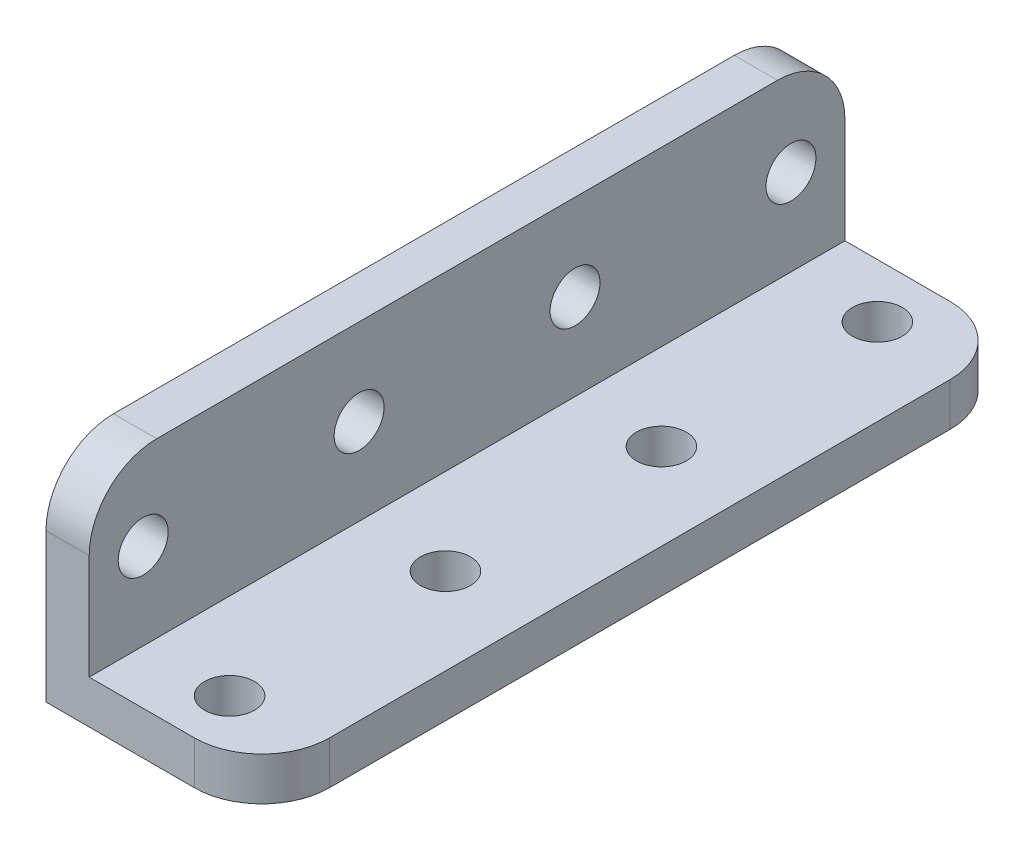
ISO-10303-21;
HEADER;
FILE_DESCRIPTION(('STEP AP214'),'2;1');
FILE_NAME('part.step','',(''),(''),'','','');
FILE_SCHEMA(('AUTOMOTIVE_DESIGN { 1 0 10303 214 1 1 1 1 }'));
ENDSEC;
DATA;
#1=APPLICATION_CONTEXT('core data for automotive mechanical design processes');
#2=APPLICATION_PROTOCOL_DEFINITION('international standard','automotive_design',2000,#1);
#3=PRODUCT_CONTEXT('',#1,'mechanical');
#4=PRODUCT('Part','Part','',(#3));
#5=PRODUCT_RELATED_PRODUCT_CATEGORY('part','',(#4));
#6=PRODUCT_DEFINITION_FORMATION('','',#4);
#7=PRODUCT_DEFINITION_CONTEXT('part definition',#1,'design');
#8=PRODUCT_DEFINITION('design','',#6,#7);
#9=PRODUCT_DEFINITION_SHAPE('','',#8);
#10=(LENGTH_UNIT() NAMED_UNIT(*) SI_UNIT(.MILLI.,.METRE.));
#11=(NAMED_UNIT(*) PLANE_ANGLE_UNIT() SI_UNIT($,.RADIAN.));
#12=(NAMED_UNIT(*) SI_UNIT($,.STERADIAN.) SOLID_ANGLE_UNIT());
#13=UNCERTAINTY_MEASURE_WITH_UNIT(LENGTH_MEASURE(1.E-05),#10,'distance_accuracy_value','');
#14=(GEOMETRIC_REPRESENTATION_CONTEXT(3) GLOBAL_UNCERTAINTY_ASSIGNED_CONTEXT((#13)) GLOBAL_UNIT_ASSIGNED_CONTEXT((#10,
#11,#12)) REPRESENTATION_CONTEXT('',''));
#15=CARTESIAN_POINT('',(0.,0.,0.));
#16=DIRECTION('',(0.,0.,1.));
#17=DIRECTION('',(1.,0.,0.));
#18=AXIS2_PLACEMENT_3D('',#15,#16,#17);
#19=CARTESIAN_POINT('',(16.,0.,0.));
#20=DIRECTION('',(1.,0.,0.));
#21=DIRECTION('',(0.,0.,-1.));
#22=AXIS2_PLACEMENT_3D('',#19,#20,#21);
#23=PLANE('',#22);
#24=DIRECTION('',(0.,0.,1.));
#25=VECTOR('',#24,1.);
#26=CARTESIAN_POINT('',(16.,3.2,0.));
#27=LINE('',#26,#25);
#28=CARTESIAN_POINT('',(16.,3.2,-25.));
#29=VERTEX_POINT('',#28);
#30=CARTESIAN_POINT('',(16.,3.2,-71.));
#31=VERTEX_POINT('',#30);
#32=EDGE_CURVE('E160',#29,#31,#27,.F.);
#33=ORIENTED_EDGE('',*,*,#32,.F.);
#34=DIRECTION('',(0.,1.,0.));
#35=VECTOR('',#34,1.);
#36=CARTESIAN_POINT('',(16.,0.,-25.));
#37=LINE('',#36,#35);
#38=CARTESIAN_POINT('',(16.,0.,-25.));
#39=VERTEX_POINT('',#38);
#40=EDGE_CURVE('E50',#29,#39,#37,.F.);
#41=ORIENTED_EDGE('',*,*,#40,.T.);
#42=DIRECTION('',(0.,0.,-1.));
#43=VECTOR('',#42,1.);
#44=CARTESIAN_POINT('',(16.,0.,0.));
#45=LINE('',#44,#43);
#46=CARTESIAN_POINT('',(16.,0.,-71.));
#47=VERTEX_POINT('',#46);
#48=EDGE_CURVE('E140',#47,#39,#45,.F.);
#49=ORIENTED_EDGE('',*,*,#48,.F.);
#50=DIRECTION('',(0.,1.,0.));
#51=VECTOR('',#50,1.);
#52=CARTESIAN_POINT('',(16.,3.2,-71.));
#53=LINE('',#52,#51);
#54=EDGE_CURVE('E420',#47,#31,#53,.T.);
#55=ORIENTED_EDGE('',*,*,#54,.T.);
#56=EDGE_LOOP('',(#33,#41,#49,#55));
#57=FACE_BOUND('',#56,.T.);
#58=ADVANCED_FACE('F35',(#57),#23,.T.);
#59=CARTESIAN_POINT('',(9.6,3.2,-24.));
#60=DIRECTION('',(0.,-1.,0.));
#61=DIRECTION('',(0.,0.,-1.));
#62=AXIS2_PLACEMENT_3D('',#59,#60,#61);
#63=CYLINDRICAL_SURFACE('',#62,1.85);
#64=CARTESIAN_POINT('',(9.6,3.2,-24.));
#65=DIRECTION('',(0.,-1.,0.));
#66=DIRECTION('',(0.,0.,-1.));
#67=AXIS2_PLACEMENT_3D('',#64,#65,#66);
#68=CIRCLE('',#67,1.85);
#69=CARTESIAN_POINT('',(9.6,3.2,-25.85));
#70=VERTEX_POINT('',#69);
#71=EDGE_CURVE('E162',#70,#70,#68,.T.);
#72=ORIENTED_EDGE('',*,*,#71,.F.);
#73=EDGE_LOOP('',(#72));
#74=FACE_BOUND('',#73,.T.);
#75=CARTESIAN_POINT('',(9.6,0.,-24.));
#76=DIRECTION('',(0.,-1.,0.));
#77=DIRECTION('',(0.,0.,-1.));
#78=AXIS2_PLACEMENT_3D('',#75,#76,#77);
#79=CIRCLE('',#78,1.85);
#80=CARTESIAN_POINT('',(9.6,0.,-25.85));
#81=VERTEX_POINT('',#80);
#82=EDGE_CURVE('E143',#81,#81,#79,.F.);
#83=ORIENTED_EDGE('',*,*,#82,.F.);
#84=EDGE_LOOP('',(#83));
#85=FACE_BOUND('',#84,.T.);
#86=ADVANCED_FACE('F208',(#74,#85),#63,.F.);
#87=CARTESIAN_POINT('',(9.6,3.2,-40.));
#88=DIRECTION('',(0.,-1.,0.));
#89=DIRECTION('',(0.,0.,-1.));
#90=AXIS2_PLACEMENT_3D('',#87,#88,#89);
#91=CYLINDRICAL_SURFACE('',#90,1.85);
#92=CARTESIAN_POINT('',(9.6,3.2,-40.));
#93=DIRECTION('',(0.,-1.,0.));
#94=DIRECTION('',(0.,0.,-1.));
#95=AXIS2_PLACEMENT_3D('',#92,#93,#94);
#96=CIRCLE('',#95,1.85);
#97=CARTESIAN_POINT('',(9.6,3.2,-41.85));
#98=VERTEX_POINT('',#97);
#99=EDGE_CURVE('E202',#98,#98,#96,.T.);
#100=ORIENTED_EDGE('',*,*,#99,.F.);
#101=EDGE_LOOP('',(#100));
#102=FACE_BOUND('',#101,.T.);
#103=CARTESIAN_POINT('',(9.6,0.,-40.));
#104=DIRECTION('',(0.,-1.,0.));
#105=DIRECTION('',(0.,0.,-1.));
#106=AXIS2_PLACEMENT_3D('',#103,#104,#105);
#107=CIRCLE('',#106,1.85);
#108=CARTESIAN_POINT('',(9.6,0.,-41.85));
#109=VERTEX_POINT('',#108);
#110=EDGE_CURVE('E195',#109,#109,#107,.F.);
#111=ORIENTED_EDGE('',*,*,#110,.F.);
#112=EDGE_LOOP('',(#111));
#113=FACE_BOUND('',#112,.T.);
#114=ADVANCED_FACE('F211',(#102,#113),#91,.F.);
#115=CARTESIAN_POINT('',(9.6,3.2,-56.));
#116=DIRECTION('',(0.,-1.,0.));
#117=DIRECTION('',(0.,0.,-1.));
#118=AXIS2_PLACEMENT_3D('',#115,#116,#117);
#119=CYLINDRICAL_SURFACE('',#118,1.85);
#120=CARTESIAN_POINT('',(9.6,3.2,-56.));
#121=DIRECTION('',(0.,-1.,0.));
#122=DIRECTION('',(0.,0.,-1.));
#123=AXIS2_PLACEMENT_3D('',#120,#121,#122);
#124=CIRCLE('',#123,1.85);
#125=CARTESIAN_POINT('',(9.6,3.2,-57.85));
#126=VERTEX_POINT('',#125);
#127=EDGE_CURVE('E146',#126,#126,#124,.T.);
#128=ORIENTED_EDGE('',*,*,#127,.F.);
#129=EDGE_LOOP('',(#128));
#130=FACE_BOUND('',#129,.T.);
#131=CARTESIAN_POINT('',(9.6,0.,-56.));
#132=DIRECTION('',(0.,-1.,0.));
#133=DIRECTION('',(0.,0.,-1.));
#134=AXIS2_PLACEMENT_3D('',#131,#132,#133);
#135=CIRCLE('',#134,1.85);
#136=CARTESIAN_POINT('',(9.6,0.,-57.85));
#137=VERTEX_POINT('',#136);
#138=EDGE_CURVE('E192',#137,#137,#135,.F.);
#139=ORIENTED_EDGE('',*,*,#138,.F.);
#140=EDGE_LOOP('',(#139));
#141=FACE_BOUND('',#140,.T.);
#142=ADVANCED_FACE('F345',(#130,#141),#119,.F.);
#143=CARTESIAN_POINT('',(9.6,3.2,-72.));
#144=DIRECTION('',(0.,-1.,0.));
#145=DIRECTION('',(0.,0.,-1.));
#146=AXIS2_PLACEMENT_3D('',#143,#144,#145);
#147=CYLINDRICAL_SURFACE('',#146,1.85);
#148=CARTESIAN_POINT('',(9.6,3.2,-72.));
#149=DIRECTION('',(0.,-1.,0.));
#150=DIRECTION('',(0.,0.,-1.));
#151=AXIS2_PLACEMENT_3D('',#148,#149,#150);
#152=CIRCLE('',#151,1.85);
#153=CARTESIAN_POINT('',(9.6,3.2,-73.85));
#154=VERTEX_POINT('',#153);
#155=EDGE_CURVE('E141',#154,#154,#152,.T.);
#156=ORIENTED_EDGE('',*,*,#155,.F.);
#157=EDGE_LOOP('',(#156));
#158=FACE_BOUND('',#157,.T.);
#159=CARTESIAN_POINT('',(9.6,0.,-72.));
#160=DIRECTION('',(0.,-1.,0.));
#161=DIRECTION('',(0.,0.,-1.));
#162=AXIS2_PLACEMENT_3D('',#159,#160,#161);
#163=CIRCLE('',#162,1.85);
#164=CARTESIAN_POINT('',(9.6,0.,-73.85));
#165=VERTEX_POINT('',#164);
#166=EDGE_CURVE('E189',#165,#165,#163,.F.);
#167=ORIENTED_EDGE('',*,*,#166,.F.);
#168=EDGE_LOOP('',(#167));
#169=FACE_BOUND('',#168,.T.);
#170=ADVANCED_FACE('F317',(#158,#169),#147,.F.);
#171=CARTESIAN_POINT('',(16.,3.2,0.));
#172=DIRECTION('',(0.,1.,0.));
#173=DIRECTION('',(0.,0.,1.));
#174=AXIS2_PLACEMENT_3D('',#171,#172,#173);
#175=PLANE('',#174);
#176=DIRECTION('',(-1.,0.,0.));
#177=VECTOR('',#176,1.);
#178=CARTESIAN_POINT('',(16.,3.2,-20.));
#179=LINE('',#178,#177);
#180=CARTESIAN_POINT('',(11.,3.2,-20.));
#181=VERTEX_POINT('',#180);
#182=CARTESIAN_POINT('',(3.2,3.2,-20.));
#183=VERTEX_POINT('',#182);
#184=EDGE_CURVE('E163',#181,#183,#179,.T.);
#185=ORIENTED_EDGE('',*,*,#184,.F.);
#186=CARTESIAN_POINT('',(11.,3.2,-25.));
#187=DIRECTION('',(0.,1.,0.));
#188=DIRECTION('',(0.,0.,1.));
#189=AXIS2_PLACEMENT_3D('',#186,#187,#188);
#190=CIRCLE('',#189,5.);
#191=EDGE_CURVE('E424',#181,#29,#190,.T.);
#192=ORIENTED_EDGE('',*,*,#191,.T.);
#193=ORIENTED_EDGE('',*,*,#32,.T.);
#194=CARTESIAN_POINT('',(11.,3.2,-71.));
#195=DIRECTION('',(0.,1.,0.));
#196=DIRECTION('',(0.,0.,1.));
#197=AXIS2_PLACEMENT_3D('',#194,#195,#196);
#198=CIRCLE('',#197,5.);
#199=CARTESIAN_POINT('',(11.,3.2,-76.));
#200=VERTEX_POINT('',#199);
#201=EDGE_CURVE('E132',#31,#200,#198,.T.);
#202=ORIENTED_EDGE('',*,*,#201,.T.);
#203=DIRECTION('',(1.,0.,0.));
#204=VECTOR('',#203,1.);
#205=CARTESIAN_POINT('',(16.,3.2,-76.));
#206=LINE('',#205,#204);
#207=CARTESIAN_POINT('',(3.2,3.2,-76.));
#208=VERTEX_POINT('',#207);
#209=EDGE_CURVE('E117',#208,#200,#206,.T.);
#210=ORIENTED_EDGE('',*,*,#209,.F.);
#211=DIRECTION('',(0.,0.,-1.));
#212=VECTOR('',#211,1.);
#213=CARTESIAN_POINT('',(3.2,3.2,0.));
#214=LINE('',#213,#212);
#215=EDGE_CURVE('E130',#183,#208,#214,.T.);
#216=ORIENTED_EDGE('',*,*,#215,.F.);
#217=EDGE_LOOP('',(#185,#192,#193,#202,#210,#216));
#218=FACE_BOUND('',#217,.T.);
#219=ORIENTED_EDGE('',*,*,#155,.T.);
#220=EDGE_LOOP('',(#219));
#221=FACE_BOUND('',#220,.T.);
#222=ORIENTED_EDGE('',*,*,#127,.T.);
#223=EDGE_LOOP('',(#222));
#224=FACE_BOUND('',#223,.T.);
#225=ORIENTED_EDGE('',*,*,#99,.T.);
#226=EDGE_LOOP('',(#225));
#227=FACE_BOUND('',#226,.T.);
#228=ORIENTED_EDGE('',*,*,#71,.T.);
#229=EDGE_LOOP('',(#228));
#230=FACE_BOUND('',#229,.T.);
#231=ADVANCED_FACE('F128',(#218,#221,#224,#227,#230),#175,.T.);
#232=CARTESIAN_POINT('',(3.2,3.2,0.));
#233=DIRECTION('',(1.,0.,0.));
#234=DIRECTION('',(0.,0.,-1.));
#235=AXIS2_PLACEMENT_3D('',#232,#233,#234);
#236=PLANE('',#235);
#237=DIRECTION('',(0.,-1.,0.));
#238=VECTOR('',#237,1.);
#239=CARTESIAN_POINT('',(3.2,3.2,-76.));
#240=LINE('',#239,#238);
#241=CARTESIAN_POINT('',(3.2,11.,-76.));
#242=VERTEX_POINT('',#241);
#243=EDGE_CURVE('E113',#242,#208,#240,.T.);
#244=ORIENTED_EDGE('',*,*,#243,.F.);
#245=CARTESIAN_POINT('',(3.2,11.,-71.));
#246=DIRECTION('',(1.,0.,0.));
#247=DIRECTION('',(0.,0.,-1.));
#248=AXIS2_PLACEMENT_3D('',#245,#246,#247);
#249=CIRCLE('',#248,5.);
#250=CARTESIAN_POINT('',(3.2,16.,-71.));
#251=VERTEX_POINT('',#250);
#252=EDGE_CURVE('E438',#242,#251,#249,.T.);
#253=ORIENTED_EDGE('',*,*,#252,.T.);
#254=DIRECTION('',(0.,0.,1.));
#255=VECTOR('',#254,1.);
#256=CARTESIAN_POINT('',(3.2,16.,0.));
#257=LINE('',#256,#255);
#258=CARTESIAN_POINT('',(3.2,16.,-25.));
#259=VERTEX_POINT('',#258);
#260=EDGE_CURVE('E159',#259,#251,#257,.F.);
#261=ORIENTED_EDGE('',*,*,#260,.F.);
#262=CARTESIAN_POINT('',(3.2,11.,-25.));
#263=DIRECTION('',(1.,0.,0.));
#264=DIRECTION('',(0.,0.,-1.));
#265=AXIS2_PLACEMENT_3D('',#262,#263,#264);
#266=CIRCLE('',#265,5.);
#267=CARTESIAN_POINT('',(3.2,11.,-20.));
#268=VERTEX_POINT('',#267);
#269=EDGE_CURVE('E440',#259,#268,#266,.T.);
#270=ORIENTED_EDGE('',*,*,#269,.T.);
#271=DIRECTION('',(0.,1.,0.));
#272=VECTOR('',#271,1.);
#273=CARTESIAN_POINT('',(3.2,3.2,-20.));
#274=LINE('',#273,#272);
#275=EDGE_CURVE('E139',#183,#268,#274,.T.);
#276=ORIENTED_EDGE('',*,*,#275,.F.);
#277=ORIENTED_EDGE('',*,*,#215,.T.);
#278=EDGE_LOOP('',(#244,#253,#261,#270,#276,#277));
#279=FACE_BOUND('',#278,.T.);
#280=CARTESIAN_POINT('',(3.2,9.6,-72.));
#281=DIRECTION('',(-1.,0.,0.));
#282=DIRECTION('',(0.,0.,1.));
#283=AXIS2_PLACEMENT_3D('',#280,#281,#282);
#284=CIRCLE('',#283,1.85);
#285=CARTESIAN_POINT('',(3.2,9.6,-70.15));
#286=VERTEX_POINT('',#285);
#287=EDGE_CURVE('E177',#286,#286,#284,.T.);
#288=ORIENTED_EDGE('',*,*,#287,.T.);
#289=EDGE_LOOP('',(#288));
#290=FACE_BOUND('',#289,.T.);
#291=CARTESIAN_POINT('',(3.2,9.6,-56.));
#292=DIRECTION('',(-1.,0.,0.));
#293=DIRECTION('',(0.,0.,1.));
#294=AXIS2_PLACEMENT_3D('',#291,#292,#293);
#295=CIRCLE('',#294,1.85);
#296=CARTESIAN_POINT('',(3.2,9.6,-54.15));
#297=VERTEX_POINT('',#296);
#298=EDGE_CURVE('E180',#297,#297,#295,.T.);
#299=ORIENTED_EDGE('',*,*,#298,.T.);
#300=EDGE_LOOP('',(#299));
#301=FACE_BOUND('',#300,.T.);
#302=CARTESIAN_POINT('',(3.2,9.6,-40.));
#303=DIRECTION('',(-1.,0.,0.));
#304=DIRECTION('',(0.,0.,1.));
#305=AXIS2_PLACEMENT_3D('',#302,#303,#304);
#306=CIRCLE('',#305,1.85);
#307=CARTESIAN_POINT('',(3.2,9.6,-38.15));
#308=VERTEX_POINT('',#307);
#309=EDGE_CURVE('E183',#308,#308,#306,.T.);
#310=ORIENTED_EDGE('',*,*,#309,.T.);
#311=EDGE_LOOP('',(#310));
#312=FACE_BOUND('',#311,.T.);
#313=CARTESIAN_POINT('',(3.2,9.6,-24.));
#314=DIRECTION('',(-1.,0.,0.));
#315=DIRECTION('',(0.,0.,1.));
#316=AXIS2_PLACEMENT_3D('',#313,#314,#315);
#317=CIRCLE('',#316,1.85);
#318=CARTESIAN_POINT('',(3.2,9.6,-22.15));
#319=VERTEX_POINT('',#318);
#320=EDGE_CURVE('E186',#319,#319,#317,.T.);
#321=ORIENTED_EDGE('',*,*,#320,.T.);
#322=EDGE_LOOP('',(#321));
#323=FACE_BOUND('',#322,.T.);
#324=ADVANCED_FACE('F136',(#279,#290,#301,#312,#323),#236,.T.);
#325=CARTESIAN_POINT('',(0.,0.,0.));
#326=DIRECTION('',(0.,-1.,0.));
#327=DIRECTION('',(0.,0.,-1.));
#328=AXIS2_PLACEMENT_3D('',#325,#326,#327);
#329=PLANE('',#328);
#330=ORIENTED_EDGE('',*,*,#48,.T.);
#331=CARTESIAN_POINT('',(11.,0.,-25.));
#332=DIRECTION('',(0.,-1.,0.));
#333=DIRECTION('',(0.,0.,-1.));
#334=AXIS2_PLACEMENT_3D('',#331,#332,#333);
#335=CIRCLE('',#334,5.);
#336=CARTESIAN_POINT('',(11.,0.,-20.));
#337=VERTEX_POINT('',#336);
#338=EDGE_CURVE('E11',#39,#337,#335,.T.);
#339=ORIENTED_EDGE('',*,*,#338,.T.);
#340=DIRECTION('',(1.,0.,0.));
#341=VECTOR('',#340,1.);
#342=CARTESIAN_POINT('',(0.,0.,-20.));
#343=LINE('',#342,#341);
#344=CARTESIAN_POINT('',(0.,0.,-20.));
#345=VERTEX_POINT('',#344);
#346=EDGE_CURVE('E133',#345,#337,#343,.T.);
#347=ORIENTED_EDGE('',*,*,#346,.F.);
#348=DIRECTION('',(0.,0.,1.));
#349=VECTOR('',#348,1.);
#350=CARTESIAN_POINT('',(0.,0.,0.));
#351=LINE('',#350,#349);
#352=CARTESIAN_POINT('',(0.,0.,-76.));
#353=VERTEX_POINT('',#352);
#354=EDGE_CURVE('E153',#353,#345,#351,.T.);
#355=ORIENTED_EDGE('',*,*,#354,.F.);
#356=DIRECTION('',(-1.,0.,0.));
#357=VECTOR('',#356,1.);
#358=CARTESIAN_POINT('',(0.,0.,-76.));
#359=LINE('',#358,#357);
#360=CARTESIAN_POINT('',(11.,0.,-76.));
#361=VERTEX_POINT('',#360);
#362=EDGE_CURVE('E123',#361,#353,#359,.T.);
#363=ORIENTED_EDGE('',*,*,#362,.F.);
#364=CARTESIAN_POINT('',(11.,0.,-71.));
#365=DIRECTION('',(0.,-1.,0.));
#366=DIRECTION('',(0.,0.,-1.));
#367=AXIS2_PLACEMENT_3D('',#364,#365,#366);
#368=CIRCLE('',#367,5.);
#369=EDGE_CURVE('E43',#361,#47,#368,.T.);
#370=ORIENTED_EDGE('',*,*,#369,.T.);
#371=EDGE_LOOP('',(#330,#339,#347,#355,#363,#370));
#372=FACE_BOUND('',#371,.T.);
#373=ORIENTED_EDGE('',*,*,#166,.T.);
#374=EDGE_LOOP('',(#373));
#375=FACE_BOUND('',#374,.T.);
#376=ORIENTED_EDGE('',*,*,#138,.T.);
#377=EDGE_LOOP('',(#376));
#378=FACE_BOUND('',#377,.T.);
#379=ORIENTED_EDGE('',*,*,#110,.T.);
#380=EDGE_LOOP('',(#379));
#381=FACE_BOUND('',#380,.T.);
#382=ORIENTED_EDGE('',*,*,#82,.T.);
#383=EDGE_LOOP('',(#382));
#384=FACE_BOUND('',#383,.T.);
#385=ADVANCED_FACE('F215',(#372,#375,#378,#381,#384),#329,.T.);
#386=CARTESIAN_POINT('',(3.2,16.,0.));
#387=DIRECTION('',(0.,1.,0.));
#388=DIRECTION('',(0.,0.,1.));
#389=AXIS2_PLACEMENT_3D('',#386,#387,#388);
#390=PLANE('',#389);
#391=ORIENTED_EDGE('',*,*,#260,.T.);
#392=DIRECTION('',(1.,0.,0.));
#393=VECTOR('',#392,1.);
#394=CARTESIAN_POINT('',(0.,16.,-71.));
#395=LINE('',#394,#393);
#396=CARTESIAN_POINT('',(0.,16.,-71.));
#397=VERTEX_POINT('',#396);
#398=EDGE_CURVE('E434',#251,#397,#395,.F.);
#399=ORIENTED_EDGE('',*,*,#398,.T.);
#400=DIRECTION('',(0.,0.,1.));
#401=VECTOR('',#400,1.);
#402=CARTESIAN_POINT('',(0.,16.,0.));
#403=LINE('',#402,#401);
#404=CARTESIAN_POINT('',(0.,16.,-25.));
#405=VERTEX_POINT('',#404);
#406=EDGE_CURVE('E176',#405,#397,#403,.F.);
#407=ORIENTED_EDGE('',*,*,#406,.F.);
#408=DIRECTION('',(-1.,0.,0.));
#409=VECTOR('',#408,1.);
#410=CARTESIAN_POINT('',(3.2,16.,-25.));
#411=LINE('',#410,#409);
#412=EDGE_CURVE('E436',#405,#259,#411,.F.);
#413=ORIENTED_EDGE('',*,*,#412,.T.);
#414=EDGE_LOOP('',(#391,#399,#407,#413));
#415=FACE_BOUND('',#414,.T.);
#416=ADVANCED_FACE('F217',(#415),#390,.T.);
#417=CARTESIAN_POINT('',(3.2,9.6,-24.));
#418=DIRECTION('',(-1.,0.,0.));
#419=DIRECTION('',(0.,0.,1.));
#420=AXIS2_PLACEMENT_3D('',#417,#418,#419);
#421=CYLINDRICAL_SURFACE('',#420,1.85);
#422=ORIENTED_EDGE('',*,*,#320,.F.);
#423=EDGE_LOOP('',(#422));
#424=FACE_BOUND('',#423,.T.);
#425=CARTESIAN_POINT('',(0.,9.6,-24.));
#426=DIRECTION('',(-1.,0.,0.));
#427=DIRECTION('',(0.,0.,1.));
#428=AXIS2_PLACEMENT_3D('',#425,#426,#427);
#429=CIRCLE('',#428,1.85);
#430=CARTESIAN_POINT('',(0.,9.6,-22.15));
#431=VERTEX_POINT('',#430);
#432=EDGE_CURVE('E173',#431,#431,#429,.F.);
#433=ORIENTED_EDGE('',*,*,#432,.F.);
#434=EDGE_LOOP('',(#433));
#435=FACE_BOUND('',#434,.T.);
#436=ADVANCED_FACE('F223',(#424,#435),#421,.F.);
#437=CARTESIAN_POINT('',(3.2,9.6,-40.));
#438=DIRECTION('',(-1.,0.,0.));
#439=DIRECTION('',(0.,0.,1.));
#440=AXIS2_PLACEMENT_3D('',#437,#438,#439);
#441=CYLINDRICAL_SURFACE('',#440,1.85);
#442=ORIENTED_EDGE('',*,*,#309,.F.);
#443=EDGE_LOOP('',(#442));
#444=FACE_BOUND('',#443,.T.);
#445=CARTESIAN_POINT('',(0.,9.6,-40.));
#446=DIRECTION('',(-1.,0.,0.));
#447=DIRECTION('',(0.,0.,1.));
#448=AXIS2_PLACEMENT_3D('',#445,#446,#447);
#449=CIRCLE('',#448,1.85);
#450=CARTESIAN_POINT('',(0.,9.6,-38.15));
#451=VERTEX_POINT('',#450);
#452=EDGE_CURVE('E170',#451,#451,#449,.F.);
#453=ORIENTED_EDGE('',*,*,#452,.F.);
#454=EDGE_LOOP('',(#453));
#455=FACE_BOUND('',#454,.T.);
#456=ADVANCED_FACE('F249',(#444,#455),#441,.F.);
#457=CARTESIAN_POINT('',(3.2,9.6,-56.));
#458=DIRECTION('',(-1.,0.,0.));
#459=DIRECTION('',(0.,0.,1.));
#460=AXIS2_PLACEMENT_3D('',#457,#458,#459);
#461=CYLINDRICAL_SURFACE('',#460,1.85);
#462=ORIENTED_EDGE('',*,*,#298,.F.);
#463=EDGE_LOOP('',(#462));
#464=FACE_BOUND('',#463,.T.);
#465=CARTESIAN_POINT('',(0.,9.6,-56.));
#466=DIRECTION('',(-1.,0.,0.));
#467=DIRECTION('',(0.,0.,1.));
#468=AXIS2_PLACEMENT_3D('',#465,#466,#467);
#469=CIRCLE('',#468,1.85);
#470=CARTESIAN_POINT('',(0.,9.6,-54.15));
#471=VERTEX_POINT('',#470);
#472=EDGE_CURVE('E167',#471,#471,#469,.F.);
#473=ORIENTED_EDGE('',*,*,#472,.F.);
#474=EDGE_LOOP('',(#473));
#475=FACE_BOUND('',#474,.T.);
#476=ADVANCED_FACE('F240',(#464,#475),#461,.F.);
#477=CARTESIAN_POINT('',(3.2,9.6,-72.));
#478=DIRECTION('',(-1.,0.,0.));
#479=DIRECTION('',(0.,0.,1.));
#480=AXIS2_PLACEMENT_3D('',#477,#478,#479);
#481=CYLINDRICAL_SURFACE('',#480,1.85);
#482=ORIENTED_EDGE('',*,*,#287,.F.);
#483=EDGE_LOOP('',(#482));
#484=FACE_BOUND('',#483,.T.);
#485=CARTESIAN_POINT('',(0.,9.6,-72.));
#486=DIRECTION('',(-1.,0.,0.));
#487=DIRECTION('',(0.,0.,1.));
#488=AXIS2_PLACEMENT_3D('',#485,#486,#487);
#489=CIRCLE('',#488,1.85);
#490=CARTESIAN_POINT('',(0.,9.6,-70.15));
#491=VERTEX_POINT('',#490);
#492=EDGE_CURVE('E164',#491,#491,#489,.F.);
#493=ORIENTED_EDGE('',*,*,#492,.F.);
#494=EDGE_LOOP('',(#493));
#495=FACE_BOUND('',#494,.T.);
#496=ADVANCED_FACE('F231',(#484,#495),#481,.F.);
#497=CARTESIAN_POINT('',(0.,16.,0.));
#498=DIRECTION('',(-1.,0.,0.));
#499=DIRECTION('',(0.,0.,1.));
#500=AXIS2_PLACEMENT_3D('',#497,#498,#499);
#501=PLANE('',#500);
#502=ORIENTED_EDGE('',*,*,#406,.T.);
#503=CARTESIAN_POINT('',(0.,11.,-71.));
#504=DIRECTION('',(-1.,0.,0.));
#505=DIRECTION('',(0.,0.,1.));
#506=AXIS2_PLACEMENT_3D('',#503,#504,#505);
#507=CIRCLE('',#506,5.);
#508=CARTESIAN_POINT('',(0.,11.,-76.));
#509=VERTEX_POINT('',#508);
#510=EDGE_CURVE('E430',#397,#509,#507,.T.);
#511=ORIENTED_EDGE('',*,*,#510,.T.);
#512=DIRECTION('',(0.,1.,0.));
#513=VECTOR('',#512,1.);
#514=CARTESIAN_POINT('',(0.,16.,-76.));
#515=LINE('',#514,#513);
#516=EDGE_CURVE('E415',#353,#509,#515,.T.);
#517=ORIENTED_EDGE('',*,*,#516,.F.);
#518=ORIENTED_EDGE('',*,*,#354,.T.);
#519=DIRECTION('',(0.,-1.,0.));
#520=VECTOR('',#519,1.);
#521=CARTESIAN_POINT('',(0.,16.,-20.));
#522=LINE('',#521,#520);
#523=CARTESIAN_POINT('',(0.,11.,-20.));
#524=VERTEX_POINT('',#523);
#525=EDGE_CURVE('E151',#524,#345,#522,.T.);
#526=ORIENTED_EDGE('',*,*,#525,.F.);
#527=CARTESIAN_POINT('',(0.,11.,-25.));
#528=DIRECTION('',(-1.,0.,0.));
#529=DIRECTION('',(0.,0.,1.));
#530=AXIS2_PLACEMENT_3D('',#527,#528,#529);
#531=CIRCLE('',#530,5.);
#532=EDGE_CURVE('E432',#524,#405,#531,.T.);
#533=ORIENTED_EDGE('',*,*,#532,.T.);
#534=EDGE_LOOP('',(#502,#511,#517,#518,#526,#533));
#535=FACE_BOUND('',#534,.T.);
#536=ORIENTED_EDGE('',*,*,#492,.T.);
#537=EDGE_LOOP('',(#536));
#538=FACE_BOUND('',#537,.T.);
#539=ORIENTED_EDGE('',*,*,#472,.T.);
#540=EDGE_LOOP('',(#539));
#541=FACE_BOUND('',#540,.T.);
#542=ORIENTED_EDGE('',*,*,#452,.T.);
#543=EDGE_LOOP('',(#542));
#544=FACE_BOUND('',#543,.T.);
#545=ORIENTED_EDGE('',*,*,#432,.T.);
#546=EDGE_LOOP('',(#545));
#547=FACE_BOUND('',#546,.T.);
#548=ADVANCED_FACE('F228',(#535,#538,#541,#544,#547),#501,.T.);
#549=CARTESIAN_POINT('',(0.,-0.000103077640641741,-20.));
#550=DIRECTION('',(0.,0.,-1.));
#551=DIRECTION('',(-1.,0.,0.));
#552=AXIS2_PLACEMENT_3D('',#549,#550,#551);
#553=PLANE('',#552);
#554=ORIENTED_EDGE('',*,*,#275,.T.);
#555=DIRECTION('',(-1.,0.,0.));
#556=VECTOR('',#555,1.);
#557=CARTESIAN_POINT('',(0.,11.,-20.));
#558=LINE('',#557,#556);
#559=EDGE_CURVE('E427',#268,#524,#558,.T.);
#560=ORIENTED_EDGE('',*,*,#559,.T.);
#561=ORIENTED_EDGE('',*,*,#525,.T.);
#562=ORIENTED_EDGE('',*,*,#346,.T.);
#563=DIRECTION('',(0.,1.,0.));
#564=VECTOR('',#563,1.);
#565=CARTESIAN_POINT('',(11.,3.2,-20.));
#566=LINE('',#565,#564);
#567=EDGE_CURVE('E400',#337,#181,#566,.T.);
#568=ORIENTED_EDGE('',*,*,#567,.T.);
#569=ORIENTED_EDGE('',*,*,#184,.T.);
#570=EDGE_LOOP('',(#554,#560,#561,#562,#568,#569));
#571=FACE_BOUND('',#570,.T.);
#572=ADVANCED_FACE('F230',(#571),#553,.F.);
#573=CARTESIAN_POINT('',(0.,-0.000103077640641741,-76.));
#574=DIRECTION('',(0.,0.,1.));
#575=DIRECTION('',(1.,0.,0.));
#576=AXIS2_PLACEMENT_3D('',#573,#574,#575);
#577=PLANE('',#576);
#578=ORIENTED_EDGE('',*,*,#516,.T.);
#579=DIRECTION('',(1.,0.,0.));
#580=VECTOR('',#579,1.);
#581=CARTESIAN_POINT('',(3.2,11.,-76.));
#582=LINE('',#581,#580);
#583=EDGE_CURVE('E120',#509,#242,#582,.T.);
#584=ORIENTED_EDGE('',*,*,#583,.T.);
#585=ORIENTED_EDGE('',*,*,#243,.T.);
#586=ORIENTED_EDGE('',*,*,#209,.T.);
#587=DIRECTION('',(0.,1.,0.));
#588=VECTOR('',#587,1.);
#589=CARTESIAN_POINT('',(11.,0.,-76.));
#590=LINE('',#589,#588);
#591=EDGE_CURVE('E418',#200,#361,#590,.F.);
#592=ORIENTED_EDGE('',*,*,#591,.T.);
#593=ORIENTED_EDGE('',*,*,#362,.T.);
#594=EDGE_LOOP('',(#578,#584,#585,#586,#592,#593));
#595=FACE_BOUND('',#594,.T.);
#596=ADVANCED_FACE('F116',(#595),#577,.F.);
#597=CARTESIAN_POINT('',(0.,11.,-71.));
#598=DIRECTION('',(-1.,0.,0.));
#599=DIRECTION('',(0.,0.,1.));
#600=AXIS2_PLACEMENT_3D('',#597,#598,#599);
#601=CYLINDRICAL_SURFACE('',#600,5.);
#602=ORIENTED_EDGE('',*,*,#510,.F.);
#603=ORIENTED_EDGE('',*,*,#398,.F.);
#604=ORIENTED_EDGE('',*,*,#252,.F.);
#605=ORIENTED_EDGE('',*,*,#583,.F.);
#606=EDGE_LOOP('',(#602,#603,#604,#605));
#607=FACE_BOUND('',#606,.T.);
#608=ADVANCED_FACE('F383',(#607),#601,.T.);
#609=CARTESIAN_POINT('',(0.,11.,-25.));
#610=DIRECTION('',(1.,0.,0.));
#611=DIRECTION('',(0.,0.,-1.));
#612=AXIS2_PLACEMENT_3D('',#609,#610,#611);
#613=CYLINDRICAL_SURFACE('',#612,5.);
#614=ORIENTED_EDGE('',*,*,#269,.F.);
#615=ORIENTED_EDGE('',*,*,#412,.F.);
#616=ORIENTED_EDGE('',*,*,#532,.F.);
#617=ORIENTED_EDGE('',*,*,#559,.F.);
#618=EDGE_LOOP('',(#614,#615,#616,#617));
#619=FACE_BOUND('',#618,.T.);
#620=ADVANCED_FACE('F386',(#619),#613,.T.);
#621=CARTESIAN_POINT('',(11.,-0.000103077640641741,-25.));
#622=DIRECTION('',(0.,-1.,0.));
#623=DIRECTION('',(0.,0.,-1.));
#624=AXIS2_PLACEMENT_3D('',#621,#622,#623);
#625=CYLINDRICAL_SURFACE('',#624,5.);
#626=ORIENTED_EDGE('',*,*,#338,.F.);
#627=ORIENTED_EDGE('',*,*,#40,.F.);
#628=ORIENTED_EDGE('',*,*,#191,.F.);
#629=ORIENTED_EDGE('',*,*,#567,.F.);
#630=EDGE_LOOP('',(#626,#627,#628,#629));
#631=FACE_BOUND('',#630,.T.);
#632=ADVANCED_FACE('F389',(#631),#625,.T.);
#633=CARTESIAN_POINT('',(11.,0.,-71.));
#634=DIRECTION('',(0.,-1.,0.));
#635=DIRECTION('',(0.,0.,-1.));
#636=AXIS2_PLACEMENT_3D('',#633,#634,#635);
#637=CYLINDRICAL_SURFACE('',#636,5.);
#638=ORIENTED_EDGE('',*,*,#369,.F.);
#639=ORIENTED_EDGE('',*,*,#591,.F.);
#640=ORIENTED_EDGE('',*,*,#201,.F.);
#641=ORIENTED_EDGE('',*,*,#54,.F.);
#642=EDGE_LOOP('',(#638,#639,#640,#641));
#643=FACE_BOUND('',#642,.T.);
#644=ADVANCED_FACE('F37',(#643),#637,.T.);
#645=CLOSED_SHELL('',(#58,#86,#114,#142,#170,#231,#324,#385,#416,#436,#456,#476,#496,#548,#572,
#596,#608,#620,#632,#644));
#646=MANIFOLD_SOLID_BREP('B2',#645);
#647=ADVANCED_BREP_SHAPE_REPRESENTATION('',(#18,#646),#14);
#648=SHAPE_DEFINITION_REPRESENTATION(#9,#647);
ENDSEC;
END-ISO-10303-21;
